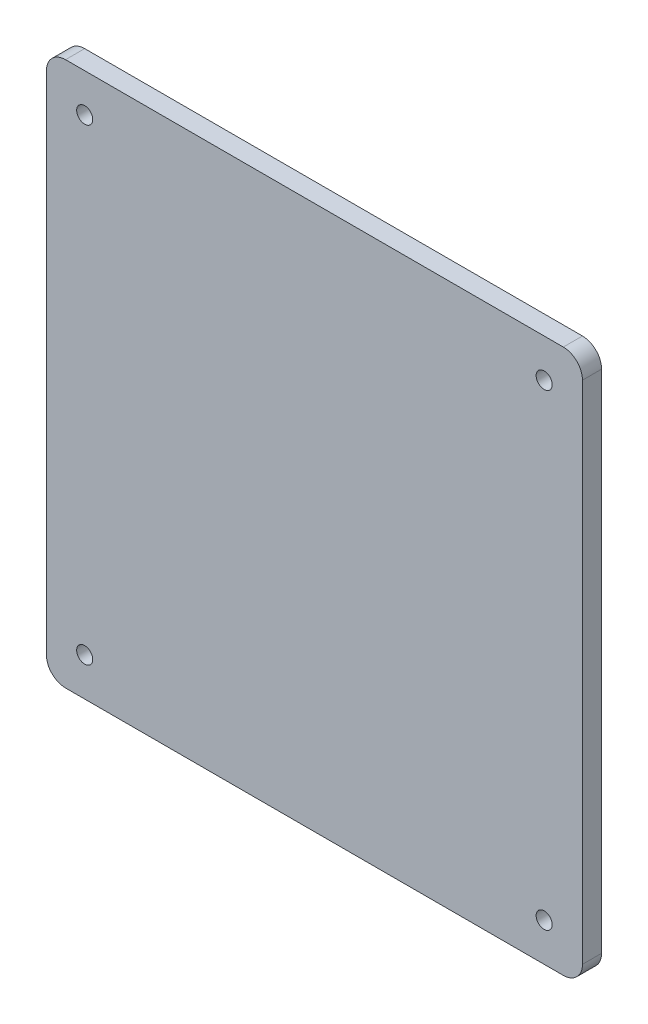
ISO-10303-21;
HEADER;
FILE_DESCRIPTION(('STEP AP214'),'2;1');
FILE_NAME('part.step','',(''),(''),'','','');
FILE_SCHEMA(('AUTOMOTIVE_DESIGN { 1 0 10303 214 1 1 1 1 }'));
ENDSEC;
DATA;
#1=APPLICATION_CONTEXT('core data for automotive mechanical design processes');
#2=APPLICATION_PROTOCOL_DEFINITION('international standard','automotive_design',2000,#1);
#3=PRODUCT_CONTEXT('',#1,'mechanical');
#4=PRODUCT('Part','Part','',(#3));
#5=PRODUCT_RELATED_PRODUCT_CATEGORY('part','',(#4));
#6=PRODUCT_DEFINITION_FORMATION('','',#4);
#7=PRODUCT_DEFINITION_CONTEXT('part definition',#1,'design');
#8=PRODUCT_DEFINITION('design','',#6,#7);
#9=PRODUCT_DEFINITION_SHAPE('','',#8);
#10=(LENGTH_UNIT() NAMED_UNIT(*) SI_UNIT(.MILLI.,.METRE.));
#11=(NAMED_UNIT(*) PLANE_ANGLE_UNIT() SI_UNIT($,.RADIAN.));
#12=(NAMED_UNIT(*) SI_UNIT($,.STERADIAN.) SOLID_ANGLE_UNIT());
#13=UNCERTAINTY_MEASURE_WITH_UNIT(LENGTH_MEASURE(1.E-05),#10,'distance_accuracy_value','');
#14=(GEOMETRIC_REPRESENTATION_CONTEXT(3) GLOBAL_UNCERTAINTY_ASSIGNED_CONTEXT((#13)) GLOBAL_UNIT_ASSIGNED_CONTEXT((#10,
#11,#12)) REPRESENTATION_CONTEXT('',''));
#15=CARTESIAN_POINT('',(0.,0.,0.));
#16=DIRECTION('',(0.,0.,1.));
#17=DIRECTION('',(1.,0.,0.));
#18=AXIS2_PLACEMENT_3D('',#15,#16,#17);
#19=CARTESIAN_POINT('',(140.,-142.125,10.));
#20=DIRECTION('',(-1.,0.,0.));
#21=DIRECTION('',(0.,0.,1.));
#22=AXIS2_PLACEMENT_3D('',#19,#20,#21);
#23=PLANE('',#22);
#24=DIRECTION('',(0.,1.,0.));
#25=VECTOR('',#24,1.);
#26=CARTESIAN_POINT('',(140.,-142.125,10.));
#27=LINE('',#26,#25);
#28=CARTESIAN_POINT('',(140.,-132.125,10.));
#29=VERTEX_POINT('',#28);
#30=CARTESIAN_POINT('',(140.,132.125,10.));
#31=VERTEX_POINT('',#30);
#32=EDGE_CURVE('E119',#29,#31,#27,.T.);
#33=ORIENTED_EDGE('',*,*,#32,.F.);
#34=DIRECTION('',(0.,0.,-1.));
#35=VECTOR('',#34,1.);
#36=CARTESIAN_POINT('',(140.,-132.125,10.));
#37=LINE('',#36,#35);
#38=CARTESIAN_POINT('',(140.,-132.125,0.));
#39=VERTEX_POINT('',#38);
#40=EDGE_CURVE('E104',#29,#39,#37,.T.);
#41=ORIENTED_EDGE('',*,*,#40,.T.);
#42=DIRECTION('',(0.,1.,0.));
#43=VECTOR('',#42,1.);
#44=CARTESIAN_POINT('',(140.,-142.125,0.));
#45=LINE('',#44,#43);
#46=CARTESIAN_POINT('',(140.,132.125,0.));
#47=VERTEX_POINT('',#46);
#48=EDGE_CURVE('E116',#39,#47,#45,.T.);
#49=ORIENTED_EDGE('',*,*,#48,.T.);
#50=DIRECTION('',(0.,0.,-1.));
#51=VECTOR('',#50,1.);
#52=CARTESIAN_POINT('',(140.,132.125,10.));
#53=LINE('',#52,#51);
#54=EDGE_CURVE('E121',#47,#31,#53,.F.);
#55=ORIENTED_EDGE('',*,*,#54,.T.);
#56=EDGE_LOOP('',(#33,#41,#49,#55));
#57=FACE_BOUND('',#56,.T.);
#58=ADVANCED_FACE('F34',(#57),#23,.F.);
#59=CARTESIAN_POINT('',(-140.,142.125,10.));
#60=DIRECTION('',(0.,-1.,0.));
#61=DIRECTION('',(0.,0.,-1.));
#62=AXIS2_PLACEMENT_3D('',#59,#60,#61);
#63=PLANE('',#62);
#64=DIRECTION('',(-1.,0.,0.));
#65=VECTOR('',#64,1.);
#66=CARTESIAN_POINT('',(-140.,142.125,0.));
#67=LINE('',#66,#65);
#68=CARTESIAN_POINT('',(130.,142.125,0.));
#69=VERTEX_POINT('',#68);
#70=CARTESIAN_POINT('',(-130.,142.125,0.));
#71=VERTEX_POINT('',#70);
#72=EDGE_CURVE('E125',#69,#71,#67,.T.);
#73=ORIENTED_EDGE('',*,*,#72,.T.);
#74=DIRECTION('',(0.,0.,-1.));
#75=VECTOR('',#74,1.);
#76=CARTESIAN_POINT('',(-130.,142.125,10.));
#77=LINE('',#76,#75);
#78=CARTESIAN_POINT('',(-130.,142.125,10.));
#79=VERTEX_POINT('',#78);
#80=EDGE_CURVE('E11',#71,#79,#77,.F.);
#81=ORIENTED_EDGE('',*,*,#80,.T.);
#82=DIRECTION('',(-1.,0.,0.));
#83=VECTOR('',#82,1.);
#84=CARTESIAN_POINT('',(-140.,142.125,10.));
#85=LINE('',#84,#83);
#86=CARTESIAN_POINT('',(130.,142.125,10.));
#87=VERTEX_POINT('',#86);
#88=EDGE_CURVE('E165',#87,#79,#85,.T.);
#89=ORIENTED_EDGE('',*,*,#88,.F.);
#90=DIRECTION('',(0.,0.,-1.));
#91=VECTOR('',#90,1.);
#92=CARTESIAN_POINT('',(130.,142.125,10.));
#93=LINE('',#92,#91);
#94=EDGE_CURVE('E42',#87,#69,#93,.T.);
#95=ORIENTED_EDGE('',*,*,#94,.T.);
#96=EDGE_LOOP('',(#73,#81,#89,#95));
#97=FACE_BOUND('',#96,.T.);
#98=ADVANCED_FACE('F163',(#97),#63,.F.);
#99=CARTESIAN_POINT('',(-140.,-142.125,10.));
#100=DIRECTION('',(1.,0.,0.));
#101=DIRECTION('',(0.,0.,-1.));
#102=AXIS2_PLACEMENT_3D('',#99,#100,#101);
#103=PLANE('',#102);
#104=DIRECTION('',(0.,-1.,0.));
#105=VECTOR('',#104,1.);
#106=CARTESIAN_POINT('',(-140.,-142.125,0.));
#107=LINE('',#106,#105);
#108=CARTESIAN_POINT('',(-140.,132.125,0.));
#109=VERTEX_POINT('',#108);
#110=CARTESIAN_POINT('',(-140.,-132.125,0.));
#111=VERTEX_POINT('',#110);
#112=EDGE_CURVE('E129',#109,#111,#107,.T.);
#113=ORIENTED_EDGE('',*,*,#112,.T.);
#114=DIRECTION('',(0.,0.,-1.));
#115=VECTOR('',#114,1.);
#116=CARTESIAN_POINT('',(-140.,-132.125,10.));
#117=LINE('',#116,#115);
#118=CARTESIAN_POINT('',(-140.,-132.125,10.));
#119=VERTEX_POINT('',#118);
#120=EDGE_CURVE('E49',#111,#119,#117,.F.);
#121=ORIENTED_EDGE('',*,*,#120,.T.);
#122=DIRECTION('',(0.,-1.,0.));
#123=VECTOR('',#122,1.);
#124=CARTESIAN_POINT('',(-140.,-142.125,10.));
#125=LINE('',#124,#123);
#126=CARTESIAN_POINT('',(-140.,132.125,10.));
#127=VERTEX_POINT('',#126);
#128=EDGE_CURVE('E173',#127,#119,#125,.T.);
#129=ORIENTED_EDGE('',*,*,#128,.F.);
#130=DIRECTION('',(0.,0.,-1.));
#131=VECTOR('',#130,1.);
#132=CARTESIAN_POINT('',(-140.,132.125,10.));
#133=LINE('',#132,#131);
#134=EDGE_CURVE('E156',#127,#109,#133,.T.);
#135=ORIENTED_EDGE('',*,*,#134,.T.);
#136=EDGE_LOOP('',(#113,#121,#129,#135));
#137=FACE_BOUND('',#136,.T.);
#138=ADVANCED_FACE('F172',(#137),#103,.F.);
#139=CARTESIAN_POINT('',(-140.,-142.125,10.));
#140=DIRECTION('',(0.,1.,0.));
#141=DIRECTION('',(0.,0.,1.));
#142=AXIS2_PLACEMENT_3D('',#139,#140,#141);
#143=PLANE('',#142);
#144=DIRECTION('',(1.,0.,0.));
#145=VECTOR('',#144,1.);
#146=CARTESIAN_POINT('',(-140.,-142.125,0.));
#147=LINE('',#146,#145);
#148=CARTESIAN_POINT('',(-130.,-142.125,0.));
#149=VERTEX_POINT('',#148);
#150=CARTESIAN_POINT('',(130.,-142.125,0.));
#151=VERTEX_POINT('',#150);
#152=EDGE_CURVE('E139',#149,#151,#147,.T.);
#153=ORIENTED_EDGE('',*,*,#152,.T.);
#154=DIRECTION('',(0.,0.,-1.));
#155=VECTOR('',#154,1.);
#156=CARTESIAN_POINT('',(130.,-142.125,10.));
#157=LINE('',#156,#155);
#158=CARTESIAN_POINT('',(130.,-142.125,10.));
#159=VERTEX_POINT('',#158);
#160=EDGE_CURVE('E105',#151,#159,#157,.F.);
#161=ORIENTED_EDGE('',*,*,#160,.T.);
#162=DIRECTION('',(1.,0.,0.));
#163=VECTOR('',#162,1.);
#164=CARTESIAN_POINT('',(-140.,-142.125,10.));
#165=LINE('',#164,#163);
#166=CARTESIAN_POINT('',(-130.,-142.125,10.));
#167=VERTEX_POINT('',#166);
#168=EDGE_CURVE('E135',#167,#159,#165,.T.);
#169=ORIENTED_EDGE('',*,*,#168,.F.);
#170=DIRECTION('',(0.,0.,-1.));
#171=VECTOR('',#170,1.);
#172=CARTESIAN_POINT('',(-130.,-142.125,10.));
#173=LINE('',#172,#171);
#174=EDGE_CURVE('E110',#167,#149,#173,.T.);
#175=ORIENTED_EDGE('',*,*,#174,.T.);
#176=EDGE_LOOP('',(#153,#161,#169,#175));
#177=FACE_BOUND('',#176,.T.);
#178=ADVANCED_FACE('F258',(#177),#143,.F.);
#179=CARTESIAN_POINT('',(0.,0.,10.));
#180=DIRECTION('',(0.,0.,-1.));
#181=DIRECTION('',(-1.,0.,0.));
#182=AXIS2_PLACEMENT_3D('',#179,#180,#181);
#183=PLANE('',#182);
#184=CARTESIAN_POINT('',(-120.,122.125,10.));
#185=DIRECTION('',(0.,0.,-1.));
#186=DIRECTION('',(-1.,0.,0.));
#187=AXIS2_PLACEMENT_3D('',#184,#185,#186);
#188=CIRCLE('',#187,4.2);
#189=CARTESIAN_POINT('',(-124.2,122.125,10.));
#190=VERTEX_POINT('',#189);
#191=EDGE_CURVE('E193',#190,#190,#188,.T.);
#192=ORIENTED_EDGE('',*,*,#191,.T.);
#193=EDGE_LOOP('',(#192));
#194=FACE_BOUND('',#193,.T.);
#195=CARTESIAN_POINT('',(120.,122.125,10.));
#196=DIRECTION('',(0.,0.,-1.));
#197=DIRECTION('',(-1.,0.,0.));
#198=AXIS2_PLACEMENT_3D('',#195,#196,#197);
#199=CIRCLE('',#198,4.2);
#200=CARTESIAN_POINT('',(115.8,122.125,10.));
#201=VERTEX_POINT('',#200);
#202=EDGE_CURVE('E187',#201,#201,#199,.T.);
#203=ORIENTED_EDGE('',*,*,#202,.T.);
#204=EDGE_LOOP('',(#203));
#205=FACE_BOUND('',#204,.T.);
#206=CARTESIAN_POINT('',(120.,-122.125,10.));
#207=DIRECTION('',(0.,0.,-1.));
#208=DIRECTION('',(-1.,0.,0.));
#209=AXIS2_PLACEMENT_3D('',#206,#207,#208);
#210=CIRCLE('',#209,4.2);
#211=CARTESIAN_POINT('',(115.8,-122.125,10.));
#212=VERTEX_POINT('',#211);
#213=EDGE_CURVE('E181',#212,#212,#210,.T.);
#214=ORIENTED_EDGE('',*,*,#213,.T.);
#215=EDGE_LOOP('',(#214));
#216=FACE_BOUND('',#215,.T.);
#217=CARTESIAN_POINT('',(-120.,-122.125,10.));
#218=DIRECTION('',(0.,0.,-1.));
#219=DIRECTION('',(-1.,0.,0.));
#220=AXIS2_PLACEMENT_3D('',#217,#218,#219);
#221=CIRCLE('',#220,4.2);
#222=CARTESIAN_POINT('',(-124.2,-122.125,10.));
#223=VERTEX_POINT('',#222);
#224=EDGE_CURVE('E126',#223,#223,#221,.T.);
#225=ORIENTED_EDGE('',*,*,#224,.T.);
#226=EDGE_LOOP('',(#225));
#227=FACE_BOUND('',#226,.T.);
#228=ORIENTED_EDGE('',*,*,#168,.T.);
#229=CARTESIAN_POINT('',(130.,-132.125,10.));
#230=DIRECTION('',(0.,0.,-1.));
#231=DIRECTION('',(-1.,0.,0.));
#232=AXIS2_PLACEMENT_3D('',#229,#230,#231);
#233=CIRCLE('',#232,10.);
#234=EDGE_CURVE('E154',#159,#29,#233,.F.);
#235=ORIENTED_EDGE('',*,*,#234,.T.);
#236=ORIENTED_EDGE('',*,*,#32,.T.);
#237=CARTESIAN_POINT('',(130.,132.125,10.));
#238=DIRECTION('',(0.,0.,-1.));
#239=DIRECTION('',(-1.,0.,0.));
#240=AXIS2_PLACEMENT_3D('',#237,#238,#239);
#241=CIRCLE('',#240,10.);
#242=EDGE_CURVE('E149',#31,#87,#241,.F.);
#243=ORIENTED_EDGE('',*,*,#242,.T.);
#244=ORIENTED_EDGE('',*,*,#88,.T.);
#245=CARTESIAN_POINT('',(-130.,132.125,10.));
#246=DIRECTION('',(0.,0.,-1.));
#247=DIRECTION('',(-1.,0.,0.));
#248=AXIS2_PLACEMENT_3D('',#245,#246,#247);
#249=CIRCLE('',#248,10.);
#250=EDGE_CURVE('E56',#79,#127,#249,.F.);
#251=ORIENTED_EDGE('',*,*,#250,.T.);
#252=ORIENTED_EDGE('',*,*,#128,.T.);
#253=CARTESIAN_POINT('',(-130.,-132.125,10.));
#254=DIRECTION('',(0.,0.,-1.));
#255=DIRECTION('',(-1.,0.,0.));
#256=AXIS2_PLACEMENT_3D('',#253,#254,#255);
#257=CIRCLE('',#256,10.);
#258=EDGE_CURVE('E152',#119,#167,#257,.F.);
#259=ORIENTED_EDGE('',*,*,#258,.T.);
#260=EDGE_LOOP('',(#228,#235,#236,#243,#244,#251,#252,#259));
#261=FACE_BOUND('',#260,.T.);
#262=ADVANCED_FACE('F204',(#194,#205,#216,#227,#261),#183,.F.);
#263=CARTESIAN_POINT('',(0.,0.,0.));
#264=DIRECTION('',(0.,0.,-1.));
#265=DIRECTION('',(-1.,0.,0.));
#266=AXIS2_PLACEMENT_3D('',#263,#264,#265);
#267=PLANE('',#266);
#268=CARTESIAN_POINT('',(-120.,122.125,0.));
#269=DIRECTION('',(0.,0.,-1.));
#270=DIRECTION('',(-1.,0.,0.));
#271=AXIS2_PLACEMENT_3D('',#268,#269,#270);
#272=CIRCLE('',#271,4.2);
#273=CARTESIAN_POINT('',(-124.2,122.125,0.));
#274=VERTEX_POINT('',#273);
#275=EDGE_CURVE('E196',#274,#274,#272,.T.);
#276=ORIENTED_EDGE('',*,*,#275,.F.);
#277=EDGE_LOOP('',(#276));
#278=FACE_BOUND('',#277,.T.);
#279=CARTESIAN_POINT('',(120.,122.125,0.));
#280=DIRECTION('',(0.,0.,-1.));
#281=DIRECTION('',(-1.,0.,0.));
#282=AXIS2_PLACEMENT_3D('',#279,#280,#281);
#283=CIRCLE('',#282,4.2);
#284=CARTESIAN_POINT('',(115.8,122.125,0.));
#285=VERTEX_POINT('',#284);
#286=EDGE_CURVE('E190',#285,#285,#283,.T.);
#287=ORIENTED_EDGE('',*,*,#286,.F.);
#288=EDGE_LOOP('',(#287));
#289=FACE_BOUND('',#288,.T.);
#290=CARTESIAN_POINT('',(120.,-122.125,0.));
#291=DIRECTION('',(0.,0.,-1.));
#292=DIRECTION('',(-1.,0.,0.));
#293=AXIS2_PLACEMENT_3D('',#290,#291,#292);
#294=CIRCLE('',#293,4.2);
#295=CARTESIAN_POINT('',(115.8,-122.125,0.));
#296=VERTEX_POINT('',#295);
#297=EDGE_CURVE('E184',#296,#296,#294,.T.);
#298=ORIENTED_EDGE('',*,*,#297,.F.);
#299=EDGE_LOOP('',(#298));
#300=FACE_BOUND('',#299,.T.);
#301=CARTESIAN_POINT('',(-120.,-122.125,0.));
#302=DIRECTION('',(0.,0.,-1.));
#303=DIRECTION('',(-1.,0.,0.));
#304=AXIS2_PLACEMENT_3D('',#301,#302,#303);
#305=CIRCLE('',#304,4.2);
#306=CARTESIAN_POINT('',(-124.2,-122.125,0.));
#307=VERTEX_POINT('',#306);
#308=EDGE_CURVE('E132',#307,#307,#305,.T.);
#309=ORIENTED_EDGE('',*,*,#308,.F.);
#310=EDGE_LOOP('',(#309));
#311=FACE_BOUND('',#310,.T.);
#312=ORIENTED_EDGE('',*,*,#48,.F.);
#313=CARTESIAN_POINT('',(130.,-132.125,0.));
#314=DIRECTION('',(0.,0.,-1.));
#315=DIRECTION('',(-1.,0.,0.));
#316=AXIS2_PLACEMENT_3D('',#313,#314,#315);
#317=CIRCLE('',#316,10.);
#318=EDGE_CURVE('E100',#39,#151,#317,.T.);
#319=ORIENTED_EDGE('',*,*,#318,.T.);
#320=ORIENTED_EDGE('',*,*,#152,.F.);
#321=CARTESIAN_POINT('',(-130.,-132.125,0.));
#322=DIRECTION('',(0.,0.,-1.));
#323=DIRECTION('',(-1.,0.,0.));
#324=AXIS2_PLACEMENT_3D('',#321,#322,#323);
#325=CIRCLE('',#324,10.);
#326=EDGE_CURVE('E111',#149,#111,#325,.T.);
#327=ORIENTED_EDGE('',*,*,#326,.T.);
#328=ORIENTED_EDGE('',*,*,#112,.F.);
#329=CARTESIAN_POINT('',(-130.,132.125,0.));
#330=DIRECTION('',(0.,0.,-1.));
#331=DIRECTION('',(-1.,0.,0.));
#332=AXIS2_PLACEMENT_3D('',#329,#330,#331);
#333=CIRCLE('',#332,10.);
#334=EDGE_CURVE('E143',#109,#71,#333,.T.);
#335=ORIENTED_EDGE('',*,*,#334,.T.);
#336=ORIENTED_EDGE('',*,*,#72,.F.);
#337=CARTESIAN_POINT('',(130.,132.125,0.));
#338=DIRECTION('',(0.,0.,-1.));
#339=DIRECTION('',(-1.,0.,0.));
#340=AXIS2_PLACEMENT_3D('',#337,#338,#339);
#341=CIRCLE('',#340,10.);
#342=EDGE_CURVE('E120',#69,#47,#341,.T.);
#343=ORIENTED_EDGE('',*,*,#342,.T.);
#344=EDGE_LOOP('',(#312,#319,#320,#327,#328,#335,#336,#343));
#345=FACE_BOUND('',#344,.T.);
#346=ADVANCED_FACE('F123',(#278,#289,#300,#311,#345),#267,.T.);
#347=CARTESIAN_POINT('',(130.,-132.125,10.));
#348=DIRECTION('',(0.,0.,-1.));
#349=DIRECTION('',(-1.,0.,0.));
#350=AXIS2_PLACEMENT_3D('',#347,#348,#349);
#351=CYLINDRICAL_SURFACE('',#350,10.);
#352=ORIENTED_EDGE('',*,*,#234,.F.);
#353=ORIENTED_EDGE('',*,*,#160,.F.);
#354=ORIENTED_EDGE('',*,*,#318,.F.);
#355=ORIENTED_EDGE('',*,*,#40,.F.);
#356=EDGE_LOOP('',(#352,#353,#354,#355));
#357=FACE_BOUND('',#356,.T.);
#358=ADVANCED_FACE('F103',(#357),#351,.T.);
#359=CARTESIAN_POINT('',(-130.,-132.125,10.));
#360=DIRECTION('',(0.,0.,-1.));
#361=DIRECTION('',(-1.,0.,0.));
#362=AXIS2_PLACEMENT_3D('',#359,#360,#361);
#363=CYLINDRICAL_SURFACE('',#362,10.);
#364=ORIENTED_EDGE('',*,*,#258,.F.);
#365=ORIENTED_EDGE('',*,*,#120,.F.);
#366=ORIENTED_EDGE('',*,*,#326,.F.);
#367=ORIENTED_EDGE('',*,*,#174,.F.);
#368=EDGE_LOOP('',(#364,#365,#366,#367));
#369=FACE_BOUND('',#368,.T.);
#370=ADVANCED_FACE('F236',(#369),#363,.T.);
#371=CARTESIAN_POINT('',(-130.,132.125,10.));
#372=DIRECTION('',(0.,0.,-1.));
#373=DIRECTION('',(-1.,0.,0.));
#374=AXIS2_PLACEMENT_3D('',#371,#372,#373);
#375=CYLINDRICAL_SURFACE('',#374,10.);
#376=ORIENTED_EDGE('',*,*,#250,.F.);
#377=ORIENTED_EDGE('',*,*,#80,.F.);
#378=ORIENTED_EDGE('',*,*,#334,.F.);
#379=ORIENTED_EDGE('',*,*,#134,.F.);
#380=EDGE_LOOP('',(#376,#377,#378,#379));
#381=FACE_BOUND('',#380,.T.);
#382=ADVANCED_FACE('F171',(#381),#375,.T.);
#383=CARTESIAN_POINT('',(130.,132.125,10.));
#384=DIRECTION('',(0.,0.,-1.));
#385=DIRECTION('',(-1.,0.,0.));
#386=AXIS2_PLACEMENT_3D('',#383,#384,#385);
#387=CYLINDRICAL_SURFACE('',#386,10.);
#388=ORIENTED_EDGE('',*,*,#242,.F.);
#389=ORIENTED_EDGE('',*,*,#54,.F.);
#390=ORIENTED_EDGE('',*,*,#342,.F.);
#391=ORIENTED_EDGE('',*,*,#94,.F.);
#392=EDGE_LOOP('',(#388,#389,#390,#391));
#393=FACE_BOUND('',#392,.T.);
#394=ADVANCED_FACE('F36',(#393),#387,.T.);
#395=CARTESIAN_POINT('',(-120.,-122.125,0.));
#396=DIRECTION('',(0.,0.,-1.));
#397=DIRECTION('',(-1.,0.,0.));
#398=AXIS2_PLACEMENT_3D('',#395,#396,#397);
#399=CYLINDRICAL_SURFACE('',#398,4.2);
#400=ORIENTED_EDGE('',*,*,#224,.F.);
#401=EDGE_LOOP('',(#400));
#402=FACE_BOUND('',#401,.T.);
#403=ORIENTED_EDGE('',*,*,#308,.T.);
#404=EDGE_LOOP('',(#403));
#405=FACE_BOUND('',#404,.T.);
#406=ADVANCED_FACE('F212',(#402,#405),#399,.F.);
#407=CARTESIAN_POINT('',(120.,-122.125,0.));
#408=DIRECTION('',(0.,0.,-1.));
#409=DIRECTION('',(-1.,0.,0.));
#410=AXIS2_PLACEMENT_3D('',#407,#408,#409);
#411=CYLINDRICAL_SURFACE('',#410,4.2);
#412=ORIENTED_EDGE('',*,*,#213,.F.);
#413=EDGE_LOOP('',(#412));
#414=FACE_BOUND('',#413,.T.);
#415=ORIENTED_EDGE('',*,*,#297,.T.);
#416=EDGE_LOOP('',(#415));
#417=FACE_BOUND('',#416,.T.);
#418=ADVANCED_FACE('F214',(#414,#417),#411,.F.);
#419=CARTESIAN_POINT('',(120.,122.125,0.));
#420=DIRECTION('',(0.,0.,-1.));
#421=DIRECTION('',(-1.,0.,0.));
#422=AXIS2_PLACEMENT_3D('',#419,#420,#421);
#423=CYLINDRICAL_SURFACE('',#422,4.2);
#424=ORIENTED_EDGE('',*,*,#202,.F.);
#425=EDGE_LOOP('',(#424));
#426=FACE_BOUND('',#425,.T.);
#427=ORIENTED_EDGE('',*,*,#286,.T.);
#428=EDGE_LOOP('',(#427));
#429=FACE_BOUND('',#428,.T.);
#430=ADVANCED_FACE('F221',(#426,#429),#423,.F.);
#431=CARTESIAN_POINT('',(-120.,122.125,0.));
#432=DIRECTION('',(0.,0.,-1.));
#433=DIRECTION('',(-1.,0.,0.));
#434=AXIS2_PLACEMENT_3D('',#431,#432,#433);
#435=CYLINDRICAL_SURFACE('',#434,4.2);
#436=ORIENTED_EDGE('',*,*,#191,.F.);
#437=EDGE_LOOP('',(#436));
#438=FACE_BOUND('',#437,.T.);
#439=ORIENTED_EDGE('',*,*,#275,.T.);
#440=EDGE_LOOP('',(#439));
#441=FACE_BOUND('',#440,.T.);
#442=ADVANCED_FACE('F200',(#438,#441),#435,.F.);
#443=CLOSED_SHELL('',(#58,#98,#138,#178,#262,#346,#358,#370,#382,#394,#406,#418,#430,#442));
#444=MANIFOLD_SOLID_BREP('B2',#443);
#445=ADVANCED_BREP_SHAPE_REPRESENTATION('',(#18,#444),#14);
#446=SHAPE_DEFINITION_REPRESENTATION(#9,#445);
ENDSEC;
END-ISO-10303-21;
